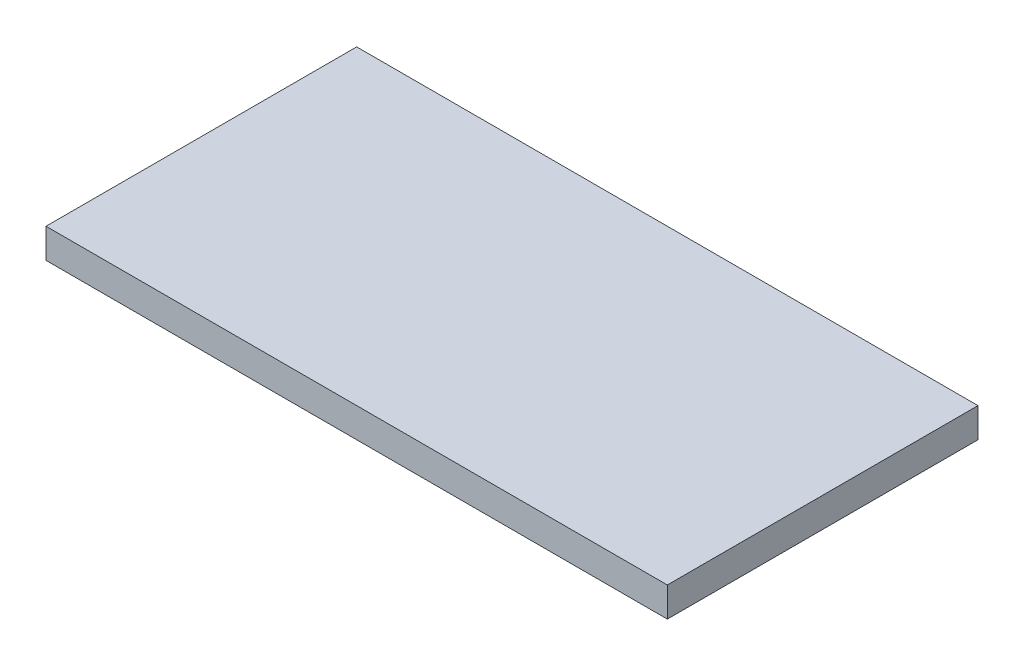
ISO-10303-21;
HEADER;
FILE_DESCRIPTION(('STEP AP214'),'2;1');
FILE_NAME('part.step','',(''),(''),'','','');
FILE_SCHEMA(('AUTOMOTIVE_DESIGN { 1 0 10303 214 1 1 1 1 }'));
ENDSEC;
DATA;
#1=APPLICATION_CONTEXT('core data for automotive mechanical design processes');
#2=APPLICATION_PROTOCOL_DEFINITION('international standard','automotive_design',2000,#1);
#3=PRODUCT_CONTEXT('',#1,'mechanical');
#4=PRODUCT('Part','Part','',(#3));
#5=PRODUCT_RELATED_PRODUCT_CATEGORY('part','',(#4));
#6=PRODUCT_DEFINITION_FORMATION('','',#4);
#7=PRODUCT_DEFINITION_CONTEXT('part definition',#1,'design');
#8=PRODUCT_DEFINITION('design','',#6,#7);
#9=PRODUCT_DEFINITION_SHAPE('','',#8);
#10=(LENGTH_UNIT() NAMED_UNIT(*) SI_UNIT(.MILLI.,.METRE.));
#11=(NAMED_UNIT(*) PLANE_ANGLE_UNIT() SI_UNIT($,.RADIAN.));
#12=(NAMED_UNIT(*) SI_UNIT($,.STERADIAN.) SOLID_ANGLE_UNIT());
#13=UNCERTAINTY_MEASURE_WITH_UNIT(LENGTH_MEASURE(1.E-05),#10,'distance_accuracy_value','');
#14=(GEOMETRIC_REPRESENTATION_CONTEXT(3) GLOBAL_UNCERTAINTY_ASSIGNED_CONTEXT((#13)) GLOBAL_UNIT_ASSIGNED_CONTEXT((#10,
#11,#12)) REPRESENTATION_CONTEXT('',''));
#15=CARTESIAN_POINT('',(0.,0.,0.));
#16=DIRECTION('',(0.,0.,1.));
#17=DIRECTION('',(1.,0.,0.));
#18=AXIS2_PLACEMENT_3D('',#15,#16,#17);
#19=CARTESIAN_POINT('',(42.,4.,-21.));
#20=DIRECTION('',(-1.,0.,0.));
#21=DIRECTION('',(0.,0.,1.));
#22=AXIS2_PLACEMENT_3D('',#19,#20,#21);
#23=PLANE('',#22);
#24=DIRECTION('',(0.,0.,-1.));
#25=VECTOR('',#24,1.);
#26=CARTESIAN_POINT('',(42.,0.,-21.));
#27=LINE('',#26,#25);
#28=CARTESIAN_POINT('',(42.,0.,21.));
#29=VERTEX_POINT('',#28);
#30=CARTESIAN_POINT('',(42.,0.,-21.));
#31=VERTEX_POINT('',#30);
#32=EDGE_CURVE('E97',#29,#31,#27,.T.);
#33=ORIENTED_EDGE('',*,*,#32,.T.);
#34=DIRECTION('',(0.,-1.,0.));
#35=VECTOR('',#34,1.);
#36=CARTESIAN_POINT('',(42.,4.,-21.));
#37=LINE('',#36,#35);
#38=CARTESIAN_POINT('',(42.,4.,-21.));
#39=VERTEX_POINT('',#38);
#40=EDGE_CURVE('E11',#39,#31,#37,.T.);
#41=ORIENTED_EDGE('',*,*,#40,.F.);
#42=DIRECTION('',(0.,0.,-1.));
#43=VECTOR('',#42,1.);
#44=CARTESIAN_POINT('',(42.,4.,-21.));
#45=LINE('',#44,#43);
#46=CARTESIAN_POINT('',(42.,4.,21.));
#47=VERTEX_POINT('',#46);
#48=EDGE_CURVE('E85',#47,#39,#45,.T.);
#49=ORIENTED_EDGE('',*,*,#48,.F.);
#50=DIRECTION('',(0.,-1.,0.));
#51=VECTOR('',#50,1.);
#52=CARTESIAN_POINT('',(42.,4.,21.));
#53=LINE('',#52,#51);
#54=EDGE_CURVE('E93',#47,#29,#53,.T.);
#55=ORIENTED_EDGE('',*,*,#54,.T.);
#56=EDGE_LOOP('',(#33,#41,#49,#55));
#57=FACE_BOUND('',#56,.T.);
#58=ADVANCED_FACE('F34',(#57),#23,.F.);
#59=CARTESIAN_POINT('',(-42.,4.,-21.));
#60=DIRECTION('',(0.,0.,1.));
#61=DIRECTION('',(1.,0.,0.));
#62=AXIS2_PLACEMENT_3D('',#59,#60,#61);
#63=PLANE('',#62);
#64=DIRECTION('',(-1.,0.,0.));
#65=VECTOR('',#64,1.);
#66=CARTESIAN_POINT('',(-42.,0.,-21.));
#67=LINE('',#66,#65);
#68=CARTESIAN_POINT('',(-42.,0.,-21.));
#69=VERTEX_POINT('',#68);
#70=EDGE_CURVE('E89',#31,#69,#67,.T.);
#71=ORIENTED_EDGE('',*,*,#70,.T.);
#72=DIRECTION('',(0.,-1.,0.));
#73=VECTOR('',#72,1.);
#74=CARTESIAN_POINT('',(-42.,4.,-21.));
#75=LINE('',#74,#73);
#76=CARTESIAN_POINT('',(-42.,4.,-21.));
#77=VERTEX_POINT('',#76);
#78=EDGE_CURVE('E42',#77,#69,#75,.T.);
#79=ORIENTED_EDGE('',*,*,#78,.F.);
#80=DIRECTION('',(-1.,0.,0.));
#81=VECTOR('',#80,1.);
#82=CARTESIAN_POINT('',(-42.,4.,-21.));
#83=LINE('',#82,#81);
#84=EDGE_CURVE('E80',#39,#77,#83,.T.);
#85=ORIENTED_EDGE('',*,*,#84,.F.);
#86=ORIENTED_EDGE('',*,*,#40,.T.);
#87=EDGE_LOOP('',(#71,#79,#85,#86));
#88=FACE_BOUND('',#87,.T.);
#89=ADVANCED_FACE('F88',(#88),#63,.F.);
#90=CARTESIAN_POINT('',(-42.,4.,-21.));
#91=DIRECTION('',(1.,0.,0.));
#92=DIRECTION('',(0.,0.,-1.));
#93=AXIS2_PLACEMENT_3D('',#90,#91,#92);
#94=PLANE('',#93);
#95=DIRECTION('',(0.,0.,1.));
#96=VECTOR('',#95,1.);
#97=CARTESIAN_POINT('',(-42.,0.,-21.));
#98=LINE('',#97,#96);
#99=CARTESIAN_POINT('',(-42.,0.,21.));
#100=VERTEX_POINT('',#99);
#101=EDGE_CURVE('E67',#69,#100,#98,.T.);
#102=ORIENTED_EDGE('',*,*,#101,.T.);
#103=DIRECTION('',(0.,-1.,0.));
#104=VECTOR('',#103,1.);
#105=CARTESIAN_POINT('',(-42.,4.,21.));
#106=LINE('',#105,#104);
#107=CARTESIAN_POINT('',(-42.,4.,21.));
#108=VERTEX_POINT('',#107);
#109=EDGE_CURVE('E90',#108,#100,#106,.T.);
#110=ORIENTED_EDGE('',*,*,#109,.F.);
#111=DIRECTION('',(0.,0.,1.));
#112=VECTOR('',#111,1.);
#113=CARTESIAN_POINT('',(-42.,4.,-21.));
#114=LINE('',#113,#112);
#115=EDGE_CURVE('E83',#77,#108,#114,.T.);
#116=ORIENTED_EDGE('',*,*,#115,.F.);
#117=ORIENTED_EDGE('',*,*,#78,.T.);
#118=EDGE_LOOP('',(#102,#110,#116,#117));
#119=FACE_BOUND('',#118,.T.);
#120=ADVANCED_FACE('F91',(#119),#94,.F.);
#121=CARTESIAN_POINT('',(-42.,4.,21.));
#122=DIRECTION('',(0.,0.,-1.));
#123=DIRECTION('',(-1.,0.,0.));
#124=AXIS2_PLACEMENT_3D('',#121,#122,#123);
#125=PLANE('',#124);
#126=DIRECTION('',(1.,0.,0.));
#127=VECTOR('',#126,1.);
#128=CARTESIAN_POINT('',(-42.,0.,21.));
#129=LINE('',#128,#127);
#130=EDGE_CURVE('E73',#100,#29,#129,.T.);
#131=ORIENTED_EDGE('',*,*,#130,.T.);
#132=ORIENTED_EDGE('',*,*,#54,.F.);
#133=DIRECTION('',(1.,0.,0.));
#134=VECTOR('',#133,1.);
#135=CARTESIAN_POINT('',(-42.,4.,21.));
#136=LINE('',#135,#134);
#137=EDGE_CURVE('E50',#108,#47,#136,.T.);
#138=ORIENTED_EDGE('',*,*,#137,.F.);
#139=ORIENTED_EDGE('',*,*,#109,.T.);
#140=EDGE_LOOP('',(#131,#132,#138,#139));
#141=FACE_BOUND('',#140,.T.);
#142=ADVANCED_FACE('F104',(#141),#125,.F.);
#143=CARTESIAN_POINT('',(0.,4.,0.));
#144=DIRECTION('',(0.,1.,0.));
#145=DIRECTION('',(0.,0.,1.));
#146=AXIS2_PLACEMENT_3D('',#143,#144,#145);
#147=PLANE('',#146);
#148=ORIENTED_EDGE('',*,*,#48,.T.);
#149=ORIENTED_EDGE('',*,*,#84,.T.);
#150=ORIENTED_EDGE('',*,*,#115,.T.);
#151=ORIENTED_EDGE('',*,*,#137,.T.);
#152=EDGE_LOOP('',(#148,#149,#150,#151));
#153=FACE_BOUND('',#152,.T.);
#154=ADVANCED_FACE('F81',(#153),#147,.T.);
#155=CARTESIAN_POINT('',(0.,0.,0.));
#156=DIRECTION('',(0.,1.,0.));
#157=DIRECTION('',(0.,0.,1.));
#158=AXIS2_PLACEMENT_3D('',#155,#156,#157);
#159=PLANE('',#158);
#160=ORIENTED_EDGE('',*,*,#32,.F.);
#161=ORIENTED_EDGE('',*,*,#130,.F.);
#162=ORIENTED_EDGE('',*,*,#101,.F.);
#163=ORIENTED_EDGE('',*,*,#70,.F.);
#164=EDGE_LOOP('',(#160,#161,#162,#163));
#165=FACE_BOUND('',#164,.T.);
#166=ADVANCED_FACE('F107',(#165),#159,.F.);
#167=CLOSED_SHELL('',(#58,#89,#120,#142,#154,#166));
#168=MANIFOLD_SOLID_BREP('B2',#167);
#169=ADVANCED_BREP_SHAPE_REPRESENTATION('',(#18,#168),#14);
#170=SHAPE_DEFINITION_REPRESENTATION(#9,#169);
ENDSEC;
END-ISO-10303-21;
